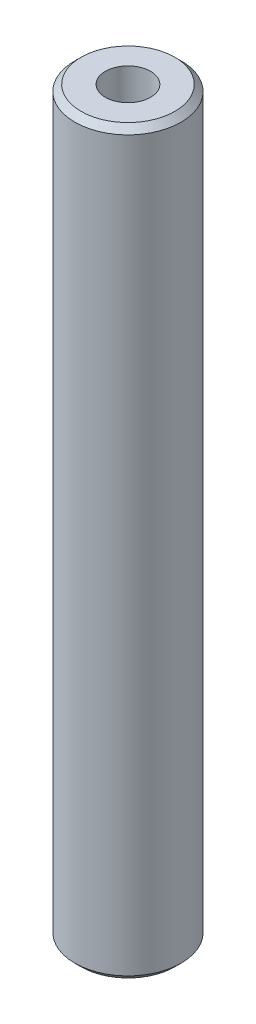
ISO-10303-21;
HEADER;
FILE_DESCRIPTION(('STEP AP214'),'2;1');
FILE_NAME('part.step','',(''),(''),'','','');
FILE_SCHEMA(('AUTOMOTIVE_DESIGN { 1 0 10303 214 1 1 1 1 }'));
ENDSEC;
DATA;
#1=APPLICATION_CONTEXT('core data for automotive mechanical design processes');
#2=APPLICATION_PROTOCOL_DEFINITION('international standard','automotive_design',2000,#1);
#3=PRODUCT_CONTEXT('',#1,'mechanical');
#4=PRODUCT('Part','Part','',(#3));
#5=PRODUCT_RELATED_PRODUCT_CATEGORY('part','',(#4));
#6=PRODUCT_DEFINITION_FORMATION('','',#4);
#7=PRODUCT_DEFINITION_CONTEXT('part definition',#1,'design');
#8=PRODUCT_DEFINITION('design','',#6,#7);
#9=PRODUCT_DEFINITION_SHAPE('','',#8);
#10=(LENGTH_UNIT() NAMED_UNIT(*) SI_UNIT(.MILLI.,.METRE.));
#11=(NAMED_UNIT(*) PLANE_ANGLE_UNIT() SI_UNIT($,.RADIAN.));
#12=(NAMED_UNIT(*) SI_UNIT($,.STERADIAN.) SOLID_ANGLE_UNIT());
#13=UNCERTAINTY_MEASURE_WITH_UNIT(LENGTH_MEASURE(1.E-05),#10,'distance_accuracy_value','');
#14=(GEOMETRIC_REPRESENTATION_CONTEXT(3) GLOBAL_UNCERTAINTY_ASSIGNED_CONTEXT((#13)) GLOBAL_UNIT_ASSIGNED_CONTEXT((#10,
#11,#12)) REPRESENTATION_CONTEXT('',''));
#15=CARTESIAN_POINT('',(0.,0.,0.));
#16=DIRECTION('',(0.,0.,1.));
#17=DIRECTION('',(1.,0.,0.));
#18=AXIS2_PLACEMENT_3D('',#15,#16,#17);
#19=CARTESIAN_POINT('',(0.,104.535098376608,0.));
#20=DIRECTION('',(0.,-1.,0.));
#21=DIRECTION('',(0.,0.,-1.));
#22=AXIS2_PLACEMENT_3D('',#19,#20,#21);
#23=CYLINDRICAL_SURFACE('',#22,7.5);
#24=CARTESIAN_POINT('',(0.,103.653334626876,0.));
#25=DIRECTION('',(0.,1.,0.));
#26=DIRECTION('',(0.,0.,1.));
#27=AXIS2_PLACEMENT_3D('',#24,#25,#26);
#28=CIRCLE('',#27,7.5);
#29=CARTESIAN_POINT('',(0.,103.653334626876,7.5));
#30=VERTEX_POINT('',#29);
#31=EDGE_CURVE('E50',#30,#30,#28,.F.);
#32=ORIENTED_EDGE('',*,*,#31,.T.);
#33=EDGE_LOOP('',(#32));
#34=FACE_BOUND('',#33,.T.);
#35=CARTESIAN_POINT('',(0.,0.881763749732395,0.));
#36=DIRECTION('',(0.,1.,0.));
#37=DIRECTION('',(0.,0.,1.));
#38=AXIS2_PLACEMENT_3D('',#35,#36,#37);
#39=CIRCLE('',#38,7.5);
#40=CARTESIAN_POINT('',(0.,0.881763749732395,7.5));
#41=VERTEX_POINT('',#40);
#42=EDGE_CURVE('E51',#41,#41,#39,.T.);
#43=ORIENTED_EDGE('',*,*,#42,.T.);
#44=EDGE_LOOP('',(#43));
#45=FACE_BOUND('',#44,.T.);
#46=ADVANCED_FACE('F39',(#34,#45),#23,.T.);
#47=CARTESIAN_POINT('',(0.,104.535098376608,0.));
#48=DIRECTION('',(0.,1.,0.));
#49=DIRECTION('',(0.,0.,1.));
#50=AXIS2_PLACEMENT_3D('',#47,#48,#49);
#51=PLANE('',#50);
#52=CARTESIAN_POINT('',(0.,104.535098376608,0.));
#53=DIRECTION('',(0.,1.,0.));
#54=DIRECTION('',(0.,0.,1.));
#55=AXIS2_PLACEMENT_3D('',#52,#53,#54);
#56=CIRCLE('',#55,6.6182362502676);
#57=CARTESIAN_POINT('',(0.,104.535098376608,6.6182362502676));
#58=VERTEX_POINT('',#57);
#59=EDGE_CURVE('E54',#58,#58,#56,.T.);
#60=ORIENTED_EDGE('',*,*,#59,.T.);
#61=EDGE_LOOP('',(#60));
#62=FACE_BOUND('',#61,.T.);
#63=CARTESIAN_POINT('',(0.,104.535098376608,0.));
#64=DIRECTION('',(0.,1.,0.));
#65=DIRECTION('',(0.,0.,1.));
#66=AXIS2_PLACEMENT_3D('',#63,#64,#65);
#67=CIRCLE('',#66,3.18533526651908);
#68=CARTESIAN_POINT('',(0.,104.535098376608,3.18533526651908));
#69=VERTEX_POINT('',#68);
#70=EDGE_CURVE('E58',#69,#69,#67,.T.);
#71=ORIENTED_EDGE('',*,*,#70,.F.);
#72=EDGE_LOOP('',(#71));
#73=FACE_BOUND('',#72,.T.);
#74=ADVANCED_FACE('F69',(#62,#73),#51,.T.);
#75=CARTESIAN_POINT('',(0.,0.,0.));
#76=DIRECTION('',(0.,1.,0.));
#77=DIRECTION('',(0.,0.,1.));
#78=AXIS2_PLACEMENT_3D('',#75,#76,#77);
#79=PLANE('',#78);
#80=CARTESIAN_POINT('',(0.,0.,0.));
#81=DIRECTION('',(0.,1.,0.));
#82=DIRECTION('',(0.,0.,1.));
#83=AXIS2_PLACEMENT_3D('',#80,#81,#82);
#84=CIRCLE('',#83,6.61823625026761);
#85=CARTESIAN_POINT('',(0.,0.,6.61823625026761));
#86=VERTEX_POINT('',#85);
#87=EDGE_CURVE('E10',#86,#86,#84,.F.);
#88=ORIENTED_EDGE('',*,*,#87,.T.);
#89=EDGE_LOOP('',(#88));
#90=FACE_BOUND('',#89,.T.);
#91=CARTESIAN_POINT('',(0.,0.,0.));
#92=DIRECTION('',(0.,1.,0.));
#93=DIRECTION('',(0.,0.,1.));
#94=AXIS2_PLACEMENT_3D('',#91,#92,#93);
#95=CIRCLE('',#94,3.18533526651908);
#96=CARTESIAN_POINT('',(0.,0.,3.18533526651908));
#97=VERTEX_POINT('',#96);
#98=EDGE_CURVE('E63',#97,#97,#95,.T.);
#99=ORIENTED_EDGE('',*,*,#98,.T.);
#100=EDGE_LOOP('',(#99));
#101=FACE_BOUND('',#100,.T.);
#102=ADVANCED_FACE('F75',(#90,#101),#79,.F.);
#103=CARTESIAN_POINT('',(0.,104.535098376608,0.));
#104=DIRECTION('',(0.,-1.,0.));
#105=DIRECTION('',(0.,0.,-1.));
#106=AXIS2_PLACEMENT_3D('',#103,#104,#105);
#107=CYLINDRICAL_SURFACE('',#106,3.18533526651908);
#108=ORIENTED_EDGE('',*,*,#70,.T.);
#109=EDGE_LOOP('',(#108));
#110=FACE_BOUND('',#109,.T.);
#111=ORIENTED_EDGE('',*,*,#98,.F.);
#112=EDGE_LOOP('',(#111));
#113=FACE_BOUND('',#112,.T.);
#114=ADVANCED_FACE('F70',(#110,#113),#107,.F.);
#115=CARTESIAN_POINT('',(0.,104.535098376608,0.));
#116=DIRECTION('',(0.,-1.,0.));
#117=DIRECTION('',(0.,0.,-1.));
#118=AXIS2_PLACEMENT_3D('',#115,#116,#117);
#119=CONICAL_SURFACE('',#118,6.6182362502676,0.785398163397444);
#120=ORIENTED_EDGE('',*,*,#31,.F.);
#121=EDGE_LOOP('',(#120));
#122=FACE_BOUND('',#121,.T.);
#123=ORIENTED_EDGE('',*,*,#59,.F.);
#124=EDGE_LOOP('',(#123));
#125=FACE_BOUND('',#124,.T.);
#126=ADVANCED_FACE('F81',(#122,#125),#119,.T.);
#127=CARTESIAN_POINT('',(0.,0.881763749732395,0.));
#128=DIRECTION('',(0.,1.,0.));
#129=DIRECTION('',(0.,0.,1.));
#130=AXIS2_PLACEMENT_3D('',#127,#128,#129);
#131=CONICAL_SURFACE('',#130,7.5,0.785398163397444);
#132=ORIENTED_EDGE('',*,*,#87,.F.);
#133=EDGE_LOOP('',(#132));
#134=FACE_BOUND('',#133,.T.);
#135=ORIENTED_EDGE('',*,*,#42,.F.);
#136=EDGE_LOOP('',(#135));
#137=FACE_BOUND('',#136,.T.);
#138=ADVANCED_FACE('F45',(#134,#137),#131,.T.);
#139=CLOSED_SHELL('',(#46,#74,#102,#114,#126,#138));
#140=MANIFOLD_SOLID_BREP('B2',#139);
#141=ADVANCED_BREP_SHAPE_REPRESENTATION('',(#18,#140),#14);
#142=SHAPE_DEFINITION_REPRESENTATION(#9,#141);
ENDSEC;
END-ISO-10303-21;
